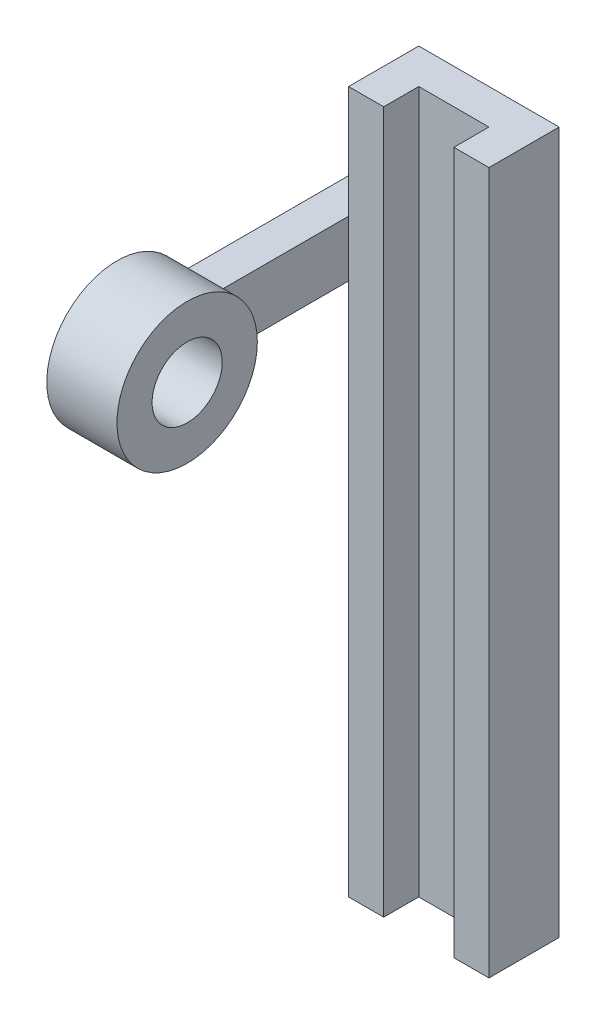
ISO-10303-21;
HEADER;
FILE_DESCRIPTION(('STEP AP214'),'2;1');
FILE_NAME('part.step','',(''),(''),'','','');
FILE_SCHEMA(('AUTOMOTIVE_DESIGN { 1 0 10303 214 1 1 1 1 }'));
ENDSEC;
DATA;
#1=APPLICATION_CONTEXT('core data for automotive mechanical design processes');
#2=APPLICATION_PROTOCOL_DEFINITION('international standard','automotive_design',2000,#1);
#3=PRODUCT_CONTEXT('',#1,'mechanical');
#4=PRODUCT('Part','Part','',(#3));
#5=PRODUCT_RELATED_PRODUCT_CATEGORY('part','',(#4));
#6=PRODUCT_DEFINITION_FORMATION('','',#4);
#7=PRODUCT_DEFINITION_CONTEXT('part definition',#1,'design');
#8=PRODUCT_DEFINITION('design','',#6,#7);
#9=PRODUCT_DEFINITION_SHAPE('','',#8);
#10=(LENGTH_UNIT() NAMED_UNIT(*) SI_UNIT(.MILLI.,.METRE.));
#11=(NAMED_UNIT(*) PLANE_ANGLE_UNIT() SI_UNIT($,.RADIAN.));
#12=(NAMED_UNIT(*) SI_UNIT($,.STERADIAN.) SOLID_ANGLE_UNIT());
#13=UNCERTAINTY_MEASURE_WITH_UNIT(LENGTH_MEASURE(1.E-05),#10,'distance_accuracy_value','');
#14=(GEOMETRIC_REPRESENTATION_CONTEXT(3) GLOBAL_UNCERTAINTY_ASSIGNED_CONTEXT((#13)) GLOBAL_UNIT_ASSIGNED_CONTEXT((#10,
#11,#12)) REPRESENTATION_CONTEXT('',''));
#15=CARTESIAN_POINT('',(0.,0.,0.));
#16=DIRECTION('',(0.,0.,1.));
#17=DIRECTION('',(1.,0.,0.));
#18=AXIS2_PLACEMENT_3D('',#15,#16,#17);
#19=CARTESIAN_POINT('',(10.,0.,20.5));
#20=DIRECTION('',(-1.,0.,0.));
#21=DIRECTION('',(0.,0.,1.));
#22=AXIS2_PLACEMENT_3D('',#19,#20,#21);
#23=CYLINDRICAL_SURFACE('',#22,5.);
#24=CARTESIAN_POINT('',(5.,0.,20.5));
#25=DIRECTION('',(-1.,0.,0.));
#26=DIRECTION('',(0.,0.,1.));
#27=AXIS2_PLACEMENT_3D('',#24,#25,#26);
#28=CIRCLE('',#27,5.);
#29=CARTESIAN_POINT('',(5.,0.,25.5));
#30=VERTEX_POINT('',#29);
#31=EDGE_CURVE('E9',#30,#30,#28,.T.);
#32=ORIENTED_EDGE('',*,*,#31,.T.);
#33=EDGE_LOOP('',(#32));
#34=FACE_BOUND('',#33,.T.);
#35=CARTESIAN_POINT('',(15.,0.,20.5));
#36=DIRECTION('',(-1.,0.,0.));
#37=DIRECTION('',(0.,0.,1.));
#38=AXIS2_PLACEMENT_3D('',#35,#36,#37);
#39=CIRCLE('',#38,5.);
#40=CARTESIAN_POINT('',(15.,0.,25.5));
#41=VERTEX_POINT('',#40);
#42=EDGE_CURVE('E181',#41,#41,#39,.T.);
#43=ORIENTED_EDGE('',*,*,#42,.F.);
#44=EDGE_LOOP('',(#43));
#45=FACE_BOUND('',#44,.T.);
#46=ADVANCED_FACE('F15',(#34,#45),#23,.F.);
#47=CARTESIAN_POINT('',(5.,0.,28.));
#48=DIRECTION('',(-1.,0.,0.));
#49=DIRECTION('',(0.,0.,1.));
#50=AXIS2_PLACEMENT_3D('',#47,#48,#49);
#51=PLANE('',#50);
#52=ORIENTED_EDGE('',*,*,#31,.F.);
#53=EDGE_LOOP('',(#52));
#54=FACE_BOUND('',#53,.T.);
#55=CARTESIAN_POINT('',(5.,0.,20.5));
#56=DIRECTION('',(-1.,0.,0.));
#57=DIRECTION('',(0.,0.,1.));
#58=AXIS2_PLACEMENT_3D('',#55,#56,#57);
#59=CIRCLE('',#58,10.);
#60=CARTESIAN_POINT('',(5.,-4.,11.3348486100883));
#61=VERTEX_POINT('',#60);
#62=CARTESIAN_POINT('',(5.,4.,11.3348486100883));
#63=VERTEX_POINT('',#62);
#64=EDGE_CURVE('E26',#61,#63,#59,.T.);
#65=ORIENTED_EDGE('',*,*,#64,.T.);
#66=DIRECTION('',(0.,0.,1.));
#67=VECTOR('',#66,1.);
#68=CARTESIAN_POINT('',(5.,4.,-12.5));
#69=LINE('',#68,#67);
#70=CARTESIAN_POINT('',(5.,4.,-12.5));
#71=VERTEX_POINT('',#70);
#72=EDGE_CURVE('E225',#71,#63,#69,.T.);
#73=ORIENTED_EDGE('',*,*,#72,.F.);
#74=DIRECTION('',(0.,1.,0.));
#75=VECTOR('',#74,1.);
#76=CARTESIAN_POINT('',(5.,-4.,-12.5));
#77=LINE('',#76,#75);
#78=CARTESIAN_POINT('',(5.,-4.,-12.5));
#79=VERTEX_POINT('',#78);
#80=EDGE_CURVE('E251',#79,#71,#77,.T.);
#81=ORIENTED_EDGE('',*,*,#80,.F.);
#82=DIRECTION('',(0.,0.,-1.));
#83=VECTOR('',#82,1.);
#84=CARTESIAN_POINT('',(5.,-4.,11.3348486100883));
#85=LINE('',#84,#83);
#86=EDGE_CURVE('E200',#61,#79,#85,.T.);
#87=ORIENTED_EDGE('',*,*,#86,.F.);
#88=EDGE_LOOP('',(#65,#73,#81,#87));
#89=FACE_BOUND('',#88,.T.);
#90=ADVANCED_FACE('F357',(#54,#89),#51,.T.);
#91=CARTESIAN_POINT('',(10.,0.,20.5));
#92=DIRECTION('',(-1.,0.,0.));
#93=DIRECTION('',(0.,0.,1.));
#94=AXIS2_PLACEMENT_3D('',#91,#92,#93);
#95=CYLINDRICAL_SURFACE('',#94,10.);
#96=ORIENTED_EDGE('',*,*,#64,.F.);
#97=DIRECTION('',(1.,0.,0.));
#98=VECTOR('',#97,1.);
#99=CARTESIAN_POINT('',(5.,-4.,11.3348486100883));
#100=LINE('',#99,#98);
#101=CARTESIAN_POINT('',(10.,-4.,11.3348486100883));
#102=VERTEX_POINT('',#101);
#103=EDGE_CURVE('E206',#61,#102,#100,.T.);
#104=ORIENTED_EDGE('',*,*,#103,.T.);
#105=CARTESIAN_POINT('',(10.,0.,20.5));
#106=DIRECTION('',(1.,0.,0.));
#107=DIRECTION('',(0.,0.,1.));
#108=AXIS2_PLACEMENT_3D('',#105,#106,#107);
#109=CIRCLE('',#108,10.);
#110=CARTESIAN_POINT('',(10.,4.,11.3348486100883));
#111=VERTEX_POINT('',#110);
#112=EDGE_CURVE('E193',#102,#111,#109,.T.);
#113=ORIENTED_EDGE('',*,*,#112,.T.);
#114=DIRECTION('',(-1.,0.,0.));
#115=VECTOR('',#114,1.);
#116=CARTESIAN_POINT('',(10.,4.,11.3348486100883));
#117=LINE('',#116,#115);
#118=EDGE_CURVE('E219',#111,#63,#117,.T.);
#119=ORIENTED_EDGE('',*,*,#118,.T.);
#120=EDGE_LOOP('',(#96,#104,#113,#119));
#121=FACE_BOUND('',#120,.T.);
#122=CARTESIAN_POINT('',(15.,0.,20.5));
#123=DIRECTION('',(-1.,0.,0.));
#124=DIRECTION('',(0.,0.,1.));
#125=AXIS2_PLACEMENT_3D('',#122,#123,#124);
#126=CIRCLE('',#125,10.);
#127=CARTESIAN_POINT('',(15.,-8.94739603583302,16.0341177604017));
#128=VERTEX_POINT('',#127);
#129=EDGE_CURVE('E184',#128,#128,#126,.T.);
#130=ORIENTED_EDGE('',*,*,#129,.T.);
#131=EDGE_LOOP('',(#130));
#132=FACE_BOUND('',#131,.T.);
#133=ADVANCED_FACE('F362',(#121,#132),#95,.T.);
#134=CARTESIAN_POINT('',(20.,20.,-12.8571428571429));
#135=DIRECTION('',(0.,1.,0.));
#136=DIRECTION('',(1.,0.,0.));
#137=AXIS2_PLACEMENT_3D('',#134,#135,#136);
#138=PLANE('',#137);
#139=DIRECTION('',(0.,0.,-1.));
#140=VECTOR('',#139,1.);
#141=CARTESIAN_POINT('',(15.,20.,-7.5));
#142=LINE('',#141,#140);
#143=CARTESIAN_POINT('',(15.,20.,-7.5));
#144=VERTEX_POINT('',#143);
#145=CARTESIAN_POINT('',(15.,20.,-12.5));
#146=VERTEX_POINT('',#145);
#147=EDGE_CURVE('E151',#144,#146,#142,.T.);
#148=ORIENTED_EDGE('',*,*,#147,.T.);
#149=DIRECTION('',(1.,0.,0.));
#150=VECTOR('',#149,1.);
#151=CARTESIAN_POINT('',(15.,20.,-12.5));
#152=LINE('',#151,#150);
#153=CARTESIAN_POINT('',(25.,20.,-12.5));
#154=VERTEX_POINT('',#153);
#155=EDGE_CURVE('E148',#146,#154,#152,.T.);
#156=ORIENTED_EDGE('',*,*,#155,.T.);
#157=DIRECTION('',(0.,0.,1.));
#158=VECTOR('',#157,1.);
#159=CARTESIAN_POINT('',(25.,20.,-12.5));
#160=LINE('',#159,#158);
#161=CARTESIAN_POINT('',(25.,20.,-7.5));
#162=VERTEX_POINT('',#161);
#163=EDGE_CURVE('E134',#154,#162,#160,.T.);
#164=ORIENTED_EDGE('',*,*,#163,.T.);
#165=DIRECTION('',(1.,0.,0.));
#166=VECTOR('',#165,1.);
#167=CARTESIAN_POINT('',(25.,20.,-7.5));
#168=LINE('',#167,#166);
#169=CARTESIAN_POINT('',(30.,20.,-7.5));
#170=VERTEX_POINT('',#169);
#171=EDGE_CURVE('E236',#162,#170,#168,.T.);
#172=ORIENTED_EDGE('',*,*,#171,.T.);
#173=DIRECTION('',(0.,0.,-1.));
#174=VECTOR('',#173,1.);
#175=CARTESIAN_POINT('',(30.,20.,-7.5));
#176=LINE('',#175,#174);
#177=CARTESIAN_POINT('',(30.,20.,-17.5));
#178=VERTEX_POINT('',#177);
#179=EDGE_CURVE('E210',#170,#178,#176,.T.);
#180=ORIENTED_EDGE('',*,*,#179,.T.);
#181=DIRECTION('',(-1.,0.,0.));
#182=VECTOR('',#181,1.);
#183=CARTESIAN_POINT('',(30.,20.,-17.5));
#184=LINE('',#183,#182);
#185=CARTESIAN_POINT('',(10.,20.,-17.5));
#186=VERTEX_POINT('',#185);
#187=EDGE_CURVE('E235',#178,#186,#184,.T.);
#188=ORIENTED_EDGE('',*,*,#187,.T.);
#189=DIRECTION('',(0.,0.,1.));
#190=VECTOR('',#189,1.);
#191=CARTESIAN_POINT('',(10.,20.,-17.5));
#192=LINE('',#191,#190);
#193=CARTESIAN_POINT('',(10.,20.,-7.5));
#194=VERTEX_POINT('',#193);
#195=EDGE_CURVE('E165',#186,#194,#192,.T.);
#196=ORIENTED_EDGE('',*,*,#195,.T.);
#197=DIRECTION('',(1.,0.,0.));
#198=VECTOR('',#197,1.);
#199=CARTESIAN_POINT('',(10.,20.,-7.5));
#200=LINE('',#199,#198);
#201=EDGE_CURVE('E229',#194,#144,#200,.T.);
#202=ORIENTED_EDGE('',*,*,#201,.T.);
#203=EDGE_LOOP('',(#148,#156,#164,#172,#180,#188,#196,#202));
#204=FACE_BOUND('',#203,.T.);
#205=ADVANCED_FACE('F149',(#204),#138,.T.);
#206=CARTESIAN_POINT('',(20.,-80.,-12.8571428571429));
#207=DIRECTION('',(0.,1.,0.));
#208=DIRECTION('',(1.,0.,0.));
#209=AXIS2_PLACEMENT_3D('',#206,#207,#208);
#210=PLANE('',#209);
#211=DIRECTION('',(1.,0.,0.));
#212=VECTOR('',#211,1.);
#213=CARTESIAN_POINT('',(15.,-80.,-12.5));
#214=LINE('',#213,#212);
#215=CARTESIAN_POINT('',(15.,-80.,-12.5));
#216=VERTEX_POINT('',#215);
#217=CARTESIAN_POINT('',(25.,-80.,-12.5));
#218=VERTEX_POINT('',#217);
#219=EDGE_CURVE('E159',#216,#218,#214,.T.);
#220=ORIENTED_EDGE('',*,*,#219,.F.);
#221=DIRECTION('',(0.,0.,-1.));
#222=VECTOR('',#221,1.);
#223=CARTESIAN_POINT('',(15.,-80.,-7.5));
#224=LINE('',#223,#222);
#225=CARTESIAN_POINT('',(15.,-80.,-7.5));
#226=VERTEX_POINT('',#225);
#227=EDGE_CURVE('E226',#226,#216,#224,.T.);
#228=ORIENTED_EDGE('',*,*,#227,.F.);
#229=DIRECTION('',(1.,0.,0.));
#230=VECTOR('',#229,1.);
#231=CARTESIAN_POINT('',(10.,-80.,-7.5));
#232=LINE('',#231,#230);
#233=CARTESIAN_POINT('',(10.,-80.,-7.5));
#234=VERTEX_POINT('',#233);
#235=EDGE_CURVE('E213',#234,#226,#232,.T.);
#236=ORIENTED_EDGE('',*,*,#235,.F.);
#237=DIRECTION('',(0.,0.,1.));
#238=VECTOR('',#237,1.);
#239=CARTESIAN_POINT('',(10.,-80.,-17.5));
#240=LINE('',#239,#238);
#241=CARTESIAN_POINT('',(10.,-80.,-17.5));
#242=VERTEX_POINT('',#241);
#243=EDGE_CURVE('E188',#242,#234,#240,.T.);
#244=ORIENTED_EDGE('',*,*,#243,.F.);
#245=DIRECTION('',(-1.,0.,0.));
#246=VECTOR('',#245,1.);
#247=CARTESIAN_POINT('',(30.,-80.,-17.5));
#248=LINE('',#247,#246);
#249=CARTESIAN_POINT('',(30.,-80.,-17.5));
#250=VERTEX_POINT('',#249);
#251=EDGE_CURVE('E234',#250,#242,#248,.T.);
#252=ORIENTED_EDGE('',*,*,#251,.F.);
#253=DIRECTION('',(0.,0.,-1.));
#254=VECTOR('',#253,1.);
#255=CARTESIAN_POINT('',(30.,-80.,-7.5));
#256=LINE('',#255,#254);
#257=CARTESIAN_POINT('',(30.,-80.,-7.5));
#258=VERTEX_POINT('',#257);
#259=EDGE_CURVE('E214',#258,#250,#256,.T.);
#260=ORIENTED_EDGE('',*,*,#259,.F.);
#261=DIRECTION('',(1.,0.,0.));
#262=VECTOR('',#261,1.);
#263=CARTESIAN_POINT('',(25.,-80.,-7.5));
#264=LINE('',#263,#262);
#265=CARTESIAN_POINT('',(25.,-80.,-7.5));
#266=VERTEX_POINT('',#265);
#267=EDGE_CURVE('E145',#266,#258,#264,.T.);
#268=ORIENTED_EDGE('',*,*,#267,.F.);
#269=DIRECTION('',(0.,0.,1.));
#270=VECTOR('',#269,1.);
#271=CARTESIAN_POINT('',(25.,-80.,-12.5));
#272=LINE('',#271,#270);
#273=EDGE_CURVE('E178',#218,#266,#272,.T.);
#274=ORIENTED_EDGE('',*,*,#273,.F.);
#275=EDGE_LOOP('',(#220,#228,#236,#244,#252,#260,#268,#274));
#276=FACE_BOUND('',#275,.T.);
#277=ADVANCED_FACE('F339',(#276),#210,.F.);
#278=CARTESIAN_POINT('',(15.,20.,-7.5));
#279=DIRECTION('',(1.,0.,0.));
#280=DIRECTION('',(0.,1.,0.));
#281=AXIS2_PLACEMENT_3D('',#278,#279,#280);
#282=PLANE('',#281);
#283=ORIENTED_EDGE('',*,*,#227,.T.);
#284=DIRECTION('',(0.,-1.,0.));
#285=VECTOR('',#284,1.);
#286=CARTESIAN_POINT('',(15.,20.,-12.5));
#287=LINE('',#286,#285);
#288=EDGE_CURVE('E156',#146,#216,#287,.T.);
#289=ORIENTED_EDGE('',*,*,#288,.F.);
#290=ORIENTED_EDGE('',*,*,#147,.F.);
#291=DIRECTION('',(0.,-1.,0.));
#292=VECTOR('',#291,1.);
#293=CARTESIAN_POINT('',(15.,20.,-7.5));
#294=LINE('',#293,#292);
#295=EDGE_CURVE('E278',#144,#226,#294,.T.);
#296=ORIENTED_EDGE('',*,*,#295,.T.);
#297=EDGE_LOOP('',(#283,#289,#290,#296));
#298=FACE_BOUND('',#297,.T.);
#299=ADVANCED_FACE('F373',(#298),#282,.T.);
#300=CARTESIAN_POINT('',(10.,20.,-7.5));
#301=DIRECTION('',(0.,0.,1.));
#302=DIRECTION('',(1.,0.,0.));
#303=AXIS2_PLACEMENT_3D('',#300,#301,#302);
#304=PLANE('',#303);
#305=ORIENTED_EDGE('',*,*,#235,.T.);
#306=ORIENTED_EDGE('',*,*,#295,.F.);
#307=ORIENTED_EDGE('',*,*,#201,.F.);
#308=DIRECTION('',(0.,-1.,0.));
#309=VECTOR('',#308,1.);
#310=CARTESIAN_POINT('',(10.,20.,-7.5));
#311=LINE('',#310,#309);
#312=CARTESIAN_POINT('',(10.,4.,-7.5));
#313=VERTEX_POINT('',#312);
#314=EDGE_CURVE('E171',#194,#313,#311,.T.);
#315=ORIENTED_EDGE('',*,*,#314,.T.);
#316=DIRECTION('',(0.,-1.,0.));
#317=VECTOR('',#316,1.);
#318=CARTESIAN_POINT('',(10.,4.,-7.5));
#319=LINE('',#318,#317);
#320=CARTESIAN_POINT('',(10.,-4.,-7.5));
#321=VERTEX_POINT('',#320);
#322=EDGE_CURVE('E196',#313,#321,#319,.T.);
#323=ORIENTED_EDGE('',*,*,#322,.T.);
#324=DIRECTION('',(0.,-1.,0.));
#325=VECTOR('',#324,1.);
#326=CARTESIAN_POINT('',(10.,-4.,-7.5));
#327=LINE('',#326,#325);
#328=EDGE_CURVE('E192',#321,#234,#327,.T.);
#329=ORIENTED_EDGE('',*,*,#328,.T.);
#330=EDGE_LOOP('',(#305,#306,#307,#315,#323,#329));
#331=FACE_BOUND('',#330,.T.);
#332=ADVANCED_FACE('F351',(#331),#304,.T.);
#333=CARTESIAN_POINT('',(30.,20.,-7.5));
#334=DIRECTION('',(1.,0.,0.));
#335=DIRECTION('',(0.,1.,0.));
#336=AXIS2_PLACEMENT_3D('',#333,#334,#335);
#337=PLANE('',#336);
#338=ORIENTED_EDGE('',*,*,#259,.T.);
#339=DIRECTION('',(0.,-1.,0.));
#340=VECTOR('',#339,1.);
#341=CARTESIAN_POINT('',(30.,20.,-17.5));
#342=LINE('',#341,#340);
#343=EDGE_CURVE('E230',#178,#250,#342,.T.);
#344=ORIENTED_EDGE('',*,*,#343,.F.);
#345=ORIENTED_EDGE('',*,*,#179,.F.);
#346=DIRECTION('',(0.,-1.,0.));
#347=VECTOR('',#346,1.);
#348=CARTESIAN_POINT('',(30.,20.,-7.5));
#349=LINE('',#348,#347);
#350=EDGE_CURVE('E239',#170,#258,#349,.T.);
#351=ORIENTED_EDGE('',*,*,#350,.T.);
#352=EDGE_LOOP('',(#338,#344,#345,#351));
#353=FACE_BOUND('',#352,.T.);
#354=ADVANCED_FACE('F343',(#353),#337,.T.);
#355=CARTESIAN_POINT('',(25.,20.,-7.5));
#356=DIRECTION('',(0.,0.,1.));
#357=DIRECTION('',(1.,0.,0.));
#358=AXIS2_PLACEMENT_3D('',#355,#356,#357);
#359=PLANE('',#358);
#360=ORIENTED_EDGE('',*,*,#267,.T.);
#361=ORIENTED_EDGE('',*,*,#350,.F.);
#362=ORIENTED_EDGE('',*,*,#171,.F.);
#363=DIRECTION('',(0.,-1.,0.));
#364=VECTOR('',#363,1.);
#365=CARTESIAN_POINT('',(25.,20.,-7.5));
#366=LINE('',#365,#364);
#367=EDGE_CURVE('E141',#162,#266,#366,.T.);
#368=ORIENTED_EDGE('',*,*,#367,.T.);
#369=EDGE_LOOP('',(#360,#361,#362,#368));
#370=FACE_BOUND('',#369,.T.);
#371=ADVANCED_FACE('F341',(#370),#359,.T.);
#372=CARTESIAN_POINT('',(25.,20.,-12.5));
#373=DIRECTION('',(-1.,0.,0.));
#374=DIRECTION('',(0.,0.,1.));
#375=AXIS2_PLACEMENT_3D('',#372,#373,#374);
#376=PLANE('',#375);
#377=ORIENTED_EDGE('',*,*,#273,.T.);
#378=ORIENTED_EDGE('',*,*,#367,.F.);
#379=ORIENTED_EDGE('',*,*,#163,.F.);
#380=DIRECTION('',(0.,-1.,0.));
#381=VECTOR('',#380,1.);
#382=CARTESIAN_POINT('',(25.,20.,-12.5));
#383=LINE('',#382,#381);
#384=EDGE_CURVE('E19',#154,#218,#383,.T.);
#385=ORIENTED_EDGE('',*,*,#384,.T.);
#386=EDGE_LOOP('',(#377,#378,#379,#385));
#387=FACE_BOUND('',#386,.T.);
#388=ADVANCED_FACE('F137',(#387),#376,.T.);
#389=CARTESIAN_POINT('',(15.,20.,-12.5));
#390=DIRECTION('',(0.,0.,1.));
#391=DIRECTION('',(1.,0.,0.));
#392=AXIS2_PLACEMENT_3D('',#389,#390,#391);
#393=PLANE('',#392);
#394=ORIENTED_EDGE('',*,*,#219,.T.);
#395=ORIENTED_EDGE('',*,*,#384,.F.);
#396=ORIENTED_EDGE('',*,*,#155,.F.);
#397=ORIENTED_EDGE('',*,*,#288,.T.);
#398=EDGE_LOOP('',(#394,#395,#396,#397));
#399=FACE_BOUND('',#398,.T.);
#400=ADVANCED_FACE('F17',(#399),#393,.T.);
#401=CARTESIAN_POINT('',(10.,20.,-17.5));
#402=DIRECTION('',(-1.,0.,0.));
#403=DIRECTION('',(0.,0.,1.));
#404=AXIS2_PLACEMENT_3D('',#401,#402,#403);
#405=PLANE('',#404);
#406=DIRECTION('',(0.,0.,1.));
#407=VECTOR('',#406,1.);
#408=CARTESIAN_POINT('',(10.,4.,-17.5));
#409=LINE('',#408,#407);
#410=CARTESIAN_POINT('',(10.,4.,-17.5));
#411=VERTEX_POINT('',#410);
#412=EDGE_CURVE('E205',#411,#313,#409,.T.);
#413=ORIENTED_EDGE('',*,*,#412,.T.);
#414=ORIENTED_EDGE('',*,*,#314,.F.);
#415=ORIENTED_EDGE('',*,*,#195,.F.);
#416=DIRECTION('',(0.,-1.,0.));
#417=VECTOR('',#416,1.);
#418=CARTESIAN_POINT('',(10.,20.,-17.5));
#419=LINE('',#418,#417);
#420=EDGE_CURVE('E256',#186,#411,#419,.T.);
#421=ORIENTED_EDGE('',*,*,#420,.T.);
#422=EDGE_LOOP('',(#413,#414,#415,#421));
#423=FACE_BOUND('',#422,.T.);
#424=ADVANCED_FACE('F370',(#423),#405,.T.);
#425=CARTESIAN_POINT('',(10.,20.,-17.5));
#426=DIRECTION('',(-1.,0.,0.));
#427=DIRECTION('',(0.,0.,1.));
#428=AXIS2_PLACEMENT_3D('',#425,#426,#427);
#429=PLANE('',#428);
#430=DIRECTION('',(0.,0.,-1.));
#431=VECTOR('',#430,1.);
#432=CARTESIAN_POINT('',(10.,-4.,-7.5));
#433=LINE('',#432,#431);
#434=CARTESIAN_POINT('',(10.,-4.,-17.5));
#435=VERTEX_POINT('',#434);
#436=EDGE_CURVE('E201',#321,#435,#433,.T.);
#437=ORIENTED_EDGE('',*,*,#436,.T.);
#438=DIRECTION('',(0.,-1.,0.));
#439=VECTOR('',#438,1.);
#440=CARTESIAN_POINT('',(10.,-4.,-17.5));
#441=LINE('',#440,#439);
#442=EDGE_CURVE('E257',#435,#242,#441,.T.);
#443=ORIENTED_EDGE('',*,*,#442,.T.);
#444=ORIENTED_EDGE('',*,*,#243,.T.);
#445=ORIENTED_EDGE('',*,*,#328,.F.);
#446=EDGE_LOOP('',(#437,#443,#444,#445));
#447=FACE_BOUND('',#446,.T.);
#448=ADVANCED_FACE('F367',(#447),#429,.T.);
#449=CARTESIAN_POINT('',(10.,0.,-3.09327319796991));
#450=DIRECTION('',(1.,0.,0.));
#451=DIRECTION('',(0.,1.,0.));
#452=AXIS2_PLACEMENT_3D('',#449,#450,#451);
#453=PLANE('',#452);
#454=ORIENTED_EDGE('',*,*,#322,.F.);
#455=DIRECTION('',(0.,0.,-1.));
#456=VECTOR('',#455,1.);
#457=CARTESIAN_POINT('',(10.,4.,11.3348486100883));
#458=LINE('',#457,#456);
#459=EDGE_CURVE('E215',#111,#313,#458,.T.);
#460=ORIENTED_EDGE('',*,*,#459,.F.);
#461=ORIENTED_EDGE('',*,*,#112,.F.);
#462=DIRECTION('',(0.,0.,1.));
#463=VECTOR('',#462,1.);
#464=CARTESIAN_POINT('',(10.,-4.,-7.5));
#465=LINE('',#464,#463);
#466=EDGE_CURVE('E204',#321,#102,#465,.T.);
#467=ORIENTED_EDGE('',*,*,#466,.F.);
#468=EDGE_LOOP('',(#454,#460,#461,#467));
#469=FACE_BOUND('',#468,.T.);
#470=ADVANCED_FACE('F369',(#469),#453,.T.);
#471=CARTESIAN_POINT('',(10.,-4.,11.3348486100883));
#472=DIRECTION('',(0.,-1.,0.));
#473=DIRECTION('',(0.,0.,-1.));
#474=AXIS2_PLACEMENT_3D('',#471,#472,#473);
#475=PLANE('',#474);
#476=DIRECTION('',(-0.707106781186548,0.,0.707106781186547));
#477=VECTOR('',#476,1.);
#478=CARTESIAN_POINT('',(10.,-4.,-17.5));
#479=LINE('',#478,#477);
#480=EDGE_CURVE('E247',#435,#79,#479,.T.);
#481=ORIENTED_EDGE('',*,*,#480,.F.);
#482=ORIENTED_EDGE('',*,*,#436,.F.);
#483=ORIENTED_EDGE('',*,*,#466,.T.);
#484=ORIENTED_EDGE('',*,*,#103,.F.);
#485=ORIENTED_EDGE('',*,*,#86,.T.);
#486=EDGE_LOOP('',(#481,#482,#483,#484,#485));
#487=FACE_BOUND('',#486,.T.);
#488=ADVANCED_FACE('F537',(#487),#475,.T.);
#489=CARTESIAN_POINT('',(10.,4.,-17.5));
#490=DIRECTION('',(0.,1.,0.));
#491=DIRECTION('',(1.,0.,0.));
#492=AXIS2_PLACEMENT_3D('',#489,#490,#491);
#493=PLANE('',#492);
#494=DIRECTION('',(0.707106781186547,0.,-0.707106781186548));
#495=VECTOR('',#494,1.);
#496=CARTESIAN_POINT('',(5.,4.,-12.5));
#497=LINE('',#496,#495);
#498=EDGE_CURVE('E183',#71,#411,#497,.T.);
#499=ORIENTED_EDGE('',*,*,#498,.F.);
#500=ORIENTED_EDGE('',*,*,#72,.T.);
#501=ORIENTED_EDGE('',*,*,#118,.F.);
#502=ORIENTED_EDGE('',*,*,#459,.T.);
#503=ORIENTED_EDGE('',*,*,#412,.F.);
#504=EDGE_LOOP('',(#499,#500,#501,#502,#503));
#505=FACE_BOUND('',#504,.T.);
#506=ADVANCED_FACE('F533',(#505),#493,.T.);
#507=CARTESIAN_POINT('',(30.,20.,-17.5));
#508=DIRECTION('',(0.,0.,-1.));
#509=DIRECTION('',(0.,-1.,0.));
#510=AXIS2_PLACEMENT_3D('',#507,#508,#509);
#511=PLANE('',#510);
#512=DIRECTION('',(0.,-1.,0.));
#513=VECTOR('',#512,1.);
#514=CARTESIAN_POINT('',(10.,4.,-17.5));
#515=LINE('',#514,#513);
#516=EDGE_CURVE('E252',#411,#435,#515,.T.);
#517=ORIENTED_EDGE('',*,*,#516,.F.);
#518=ORIENTED_EDGE('',*,*,#420,.F.);
#519=ORIENTED_EDGE('',*,*,#187,.F.);
#520=ORIENTED_EDGE('',*,*,#343,.T.);
#521=ORIENTED_EDGE('',*,*,#251,.T.);
#522=ORIENTED_EDGE('',*,*,#442,.F.);
#523=EDGE_LOOP('',(#517,#518,#519,#520,#521,#522));
#524=FACE_BOUND('',#523,.T.);
#525=ADVANCED_FACE('F319',(#524),#511,.T.);
#526=CARTESIAN_POINT('',(7.5,10.,-15.));
#527=DIRECTION('',(-0.707106781186548,0.,-0.707106781186547));
#528=DIRECTION('',(-0.707106781186547,0.,0.707106781186548));
#529=AXIS2_PLACEMENT_3D('',#526,#527,#528);
#530=PLANE('',#529);
#531=ORIENTED_EDGE('',*,*,#498,.T.);
#532=ORIENTED_EDGE('',*,*,#516,.T.);
#533=ORIENTED_EDGE('',*,*,#480,.T.);
#534=ORIENTED_EDGE('',*,*,#80,.T.);
#535=EDGE_LOOP('',(#531,#532,#533,#534));
#536=FACE_BOUND('',#535,.T.);
#537=ADVANCED_FACE('F315',(#536),#530,.T.);
#538=CARTESIAN_POINT('',(15.,0.,28.));
#539=DIRECTION('',(1.,0.,0.));
#540=DIRECTION('',(0.,1.,0.));
#541=AXIS2_PLACEMENT_3D('',#538,#539,#540);
#542=PLANE('',#541);
#543=ORIENTED_EDGE('',*,*,#42,.T.);
#544=EDGE_LOOP('',(#543));
#545=FACE_BOUND('',#544,.T.);
#546=ORIENTED_EDGE('',*,*,#129,.F.);
#547=EDGE_LOOP('',(#546));
#548=FACE_BOUND('',#547,.T.);
#549=ADVANCED_FACE('F608',(#545,#548),#542,.T.);
#550=CLOSED_SHELL('',(#46,#90,#133,#205,#277,#299,#332,#354,#371,#388,#400,#424,#448,#470,#488,
#506,#525,#537,#549));
#551=MANIFOLD_SOLID_BREP('B1',#550);
#552=ADVANCED_BREP_SHAPE_REPRESENTATION('',(#18,#551),#14);
#553=SHAPE_DEFINITION_REPRESENTATION(#9,#552);
ENDSEC;
END-ISO-10303-21;
